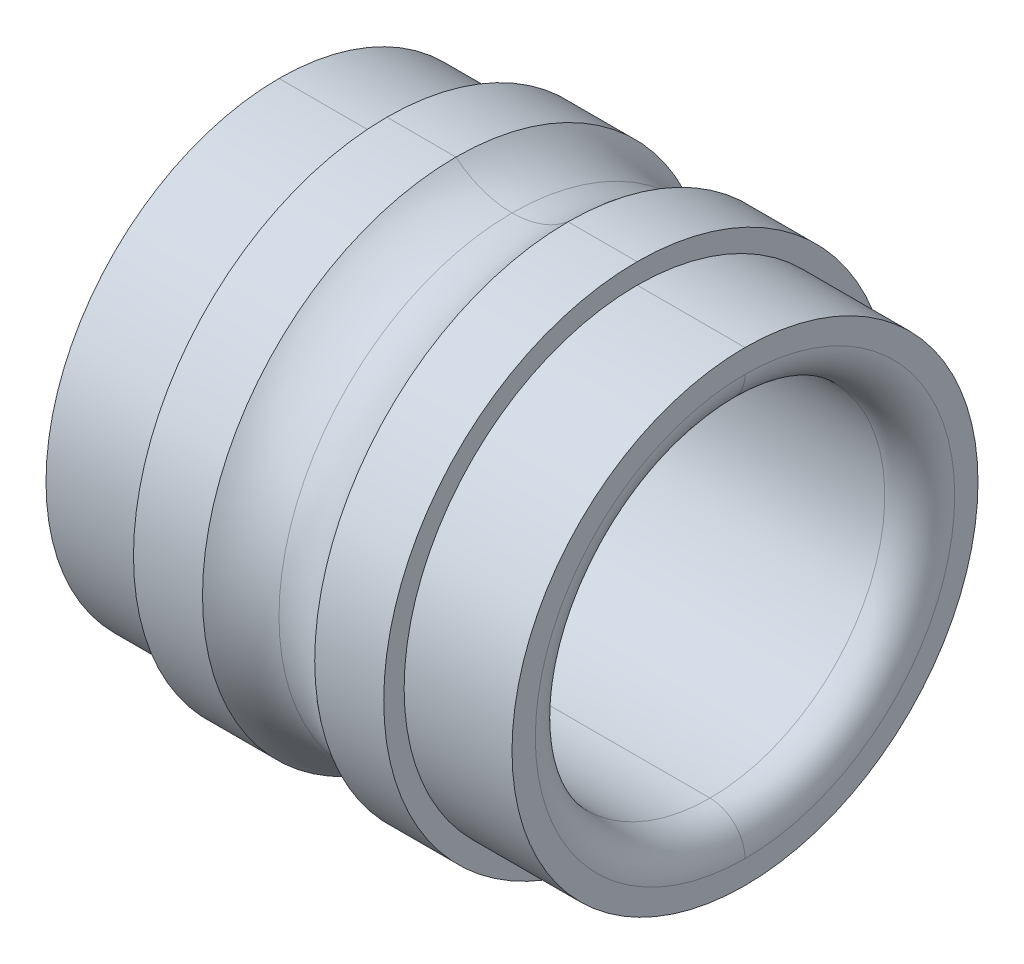
ISO-10303-21;
HEADER;
FILE_DESCRIPTION(('STEP AP214'),'2;1');
FILE_NAME('part.step','',(''),(''),'','','');
FILE_SCHEMA(('AUTOMOTIVE_DESIGN { 1 0 10303 214 1 1 1 1 }'));
ENDSEC;
DATA;
#1=APPLICATION_CONTEXT('core data for automotive mechanical design processes');
#2=APPLICATION_PROTOCOL_DEFINITION('international standard','automotive_design',2000,#1);
#3=PRODUCT_CONTEXT('',#1,'mechanical');
#4=PRODUCT('Part','Part','',(#3));
#5=PRODUCT_RELATED_PRODUCT_CATEGORY('part','',(#4));
#6=PRODUCT_DEFINITION_FORMATION('','',#4);
#7=PRODUCT_DEFINITION_CONTEXT('part definition',#1,'design');
#8=PRODUCT_DEFINITION('design','',#6,#7);
#9=PRODUCT_DEFINITION_SHAPE('','',#8);
#10=(LENGTH_UNIT() NAMED_UNIT(*) SI_UNIT(.MILLI.,.METRE.));
#11=(NAMED_UNIT(*) PLANE_ANGLE_UNIT() SI_UNIT($,.RADIAN.));
#12=(NAMED_UNIT(*) SI_UNIT($,.STERADIAN.) SOLID_ANGLE_UNIT());
#13=UNCERTAINTY_MEASURE_WITH_UNIT(LENGTH_MEASURE(1.E-05),#10,'distance_accuracy_value','');
#14=(GEOMETRIC_REPRESENTATION_CONTEXT(3) GLOBAL_UNCERTAINTY_ASSIGNED_CONTEXT((#13)) GLOBAL_UNIT_ASSIGNED_CONTEXT((#10,
#11,#12)) REPRESENTATION_CONTEXT('',''));
#15=CARTESIAN_POINT('',(0.,0.,0.));
#16=DIRECTION('',(0.,0.,1.));
#17=DIRECTION('',(1.,0.,0.));
#18=AXIS2_PLACEMENT_3D('',#15,#16,#17);
#19=CARTESIAN_POINT('',(2.,0.,0.));
#20=DIRECTION('',(1.,0.,0.));
#21=DIRECTION('',(0.,1.,0.));
#22=AXIS2_PLACEMENT_3D('',#19,#20,#21);
#23=PLANE('',#22);
#24=CARTESIAN_POINT('',(2.,0.,0.));
#25=DIRECTION('',(1.,0.,0.));
#26=DIRECTION('',(0.,-1.,0.));
#27=AXIS2_PLACEMENT_3D('',#24,#25,#26);
#28=CIRCLE('',#27,1.8);
#29=CARTESIAN_POINT('',(2.,1.8,0.));
#30=VERTEX_POINT('',#29);
#31=CARTESIAN_POINT('',(2.,-1.8,0.));
#32=VERTEX_POINT('',#31);
#33=EDGE_CURVE('E203',#30,#32,#28,.T.);
#34=ORIENTED_EDGE('',*,*,#33,.F.);
#35=CARTESIAN_POINT('',(2.,0.,0.));
#36=DIRECTION('',(1.,0.,0.));
#37=DIRECTION('',(0.,-1.,0.));
#38=AXIS2_PLACEMENT_3D('',#35,#36,#37);
#39=CIRCLE('',#38,1.8);
#40=EDGE_CURVE('E253',#32,#30,#39,.T.);
#41=ORIENTED_EDGE('',*,*,#40,.F.);
#42=EDGE_LOOP('',(#34,#41));
#43=FACE_BOUND('',#42,.T.);
#44=CARTESIAN_POINT('',(2.,0.,0.));
#45=DIRECTION('',(1.,0.,0.));
#46=DIRECTION('',(0.,1.,0.));
#47=AXIS2_PLACEMENT_3D('',#44,#45,#46);
#48=CIRCLE('',#47,2.);
#49=CARTESIAN_POINT('',(2.,2.,0.));
#50=VERTEX_POINT('',#49);
#51=CARTESIAN_POINT('',(2.,-2.,0.));
#52=VERTEX_POINT('',#51);
#53=EDGE_CURVE('E204',#50,#52,#48,.T.);
#54=ORIENTED_EDGE('',*,*,#53,.T.);
#55=CARTESIAN_POINT('',(2.,0.,0.));
#56=DIRECTION('',(1.,0.,0.));
#57=DIRECTION('',(0.,1.,0.));
#58=AXIS2_PLACEMENT_3D('',#55,#56,#57);
#59=CIRCLE('',#58,2.);
#60=EDGE_CURVE('E11',#52,#50,#59,.T.);
#61=ORIENTED_EDGE('',*,*,#60,.T.);
#62=EDGE_LOOP('',(#54,#61));
#63=FACE_BOUND('',#62,.T.);
#64=ADVANCED_FACE('F17',(#43,#63),#23,.T.);
#65=CARTESIAN_POINT('',(-2.,0.,0.));
#66=DIRECTION('',(1.,0.,0.));
#67=DIRECTION('',(0.,1.,0.));
#68=AXIS2_PLACEMENT_3D('',#65,#66,#67);
#69=CYLINDRICAL_SURFACE('',#68,2.175);
#70=DIRECTION('',(1.,0.,0.));
#71=VECTOR('',#70,1.);
#72=CARTESIAN_POINT('',(-2.,-2.175,0.));
#73=LINE('',#72,#71);
#74=CARTESIAN_POINT('',(0.481534007106446,-2.175,0.));
#75=VERTEX_POINT('',#74);
#76=CARTESIAN_POINT('',(1.07407407407409,-2.175,0.));
#77=VERTEX_POINT('',#76);
#78=EDGE_CURVE('E165',#75,#77,#73,.T.);
#79=ORIENTED_EDGE('',*,*,#78,.F.);
#80=CARTESIAN_POINT('',(0.481534007106446,0.,0.));
#81=DIRECTION('',(1.,0.,0.));
#82=DIRECTION('',(0.,1.,0.));
#83=AXIS2_PLACEMENT_3D('',#80,#81,#82);
#84=CIRCLE('',#83,2.175);
#85=CARTESIAN_POINT('',(0.481534007106446,2.175,0.));
#86=VERTEX_POINT('',#85);
#87=EDGE_CURVE('E163',#75,#86,#84,.T.);
#88=ORIENTED_EDGE('',*,*,#87,.T.);
#89=DIRECTION('',(1.,0.,0.));
#90=VECTOR('',#89,1.);
#91=CARTESIAN_POINT('',(-2.,2.175,0.));
#92=LINE('',#91,#90);
#93=CARTESIAN_POINT('',(1.07407407407409,2.175,0.));
#94=VERTEX_POINT('',#93);
#95=EDGE_CURVE('E149',#86,#94,#92,.T.);
#96=ORIENTED_EDGE('',*,*,#95,.T.);
#97=CARTESIAN_POINT('',(1.07407407407409,0.,0.));
#98=DIRECTION('',(-1.,0.,0.));
#99=DIRECTION('',(0.,1.,0.));
#100=AXIS2_PLACEMENT_3D('',#97,#98,#99);
#101=CIRCLE('',#100,2.175);
#102=EDGE_CURVE('E263',#94,#77,#101,.T.);
#103=ORIENTED_EDGE('',*,*,#102,.T.);
#104=EDGE_LOOP('',(#79,#88,#96,#103));
#105=FACE_BOUND('',#104,.T.);
#106=ADVANCED_FACE('F164',(#105),#69,.T.);
#107=CARTESIAN_POINT('',(2.,0.,0.));
#108=DIRECTION('',(1.,0.,0.));
#109=DIRECTION('',(0.,1.,0.));
#110=AXIS2_PLACEMENT_3D('',#107,#108,#109);
#111=CYLINDRICAL_SURFACE('',#110,2.);
#112=DIRECTION('',(1.,0.,0.));
#113=VECTOR('',#112,1.);
#114=CARTESIAN_POINT('',(2.,-2.,0.));
#115=LINE('',#114,#113);
#116=CARTESIAN_POINT('',(1.07407407407409,-2.,0.));
#117=VERTEX_POINT('',#116);
#118=EDGE_CURVE('E219',#117,#52,#115,.T.);
#119=ORIENTED_EDGE('',*,*,#118,.F.);
#120=CARTESIAN_POINT('',(1.07407407407409,0.,0.));
#121=DIRECTION('',(1.,0.,0.));
#122=DIRECTION('',(0.,1.,0.));
#123=AXIS2_PLACEMENT_3D('',#120,#121,#122);
#124=CIRCLE('',#123,2.);
#125=CARTESIAN_POINT('',(1.07407407407409,2.,0.));
#126=VERTEX_POINT('',#125);
#127=EDGE_CURVE('E28',#117,#126,#124,.T.);
#128=ORIENTED_EDGE('',*,*,#127,.T.);
#129=DIRECTION('',(1.,0.,0.));
#130=VECTOR('',#129,1.);
#131=CARTESIAN_POINT('',(2.,2.,0.));
#132=LINE('',#131,#130);
#133=EDGE_CURVE('E200',#126,#50,#132,.T.);
#134=ORIENTED_EDGE('',*,*,#133,.T.);
#135=ORIENTED_EDGE('',*,*,#60,.F.);
#136=EDGE_LOOP('',(#119,#128,#134,#135));
#137=FACE_BOUND('',#136,.T.);
#138=ADVANCED_FACE('F564',(#137),#111,.T.);
#139=CARTESIAN_POINT('',(1.07407407407409,0.,0.));
#140=DIRECTION('',(-1.,0.,0.));
#141=DIRECTION('',(0.,0.,1.));
#142=AXIS2_PLACEMENT_3D('',#139,#140,#141);
#143=PLANE('',#142);
#144=CARTESIAN_POINT('',(1.07407407407409,0.,0.));
#145=DIRECTION('',(1.,0.,0.));
#146=DIRECTION('',(0.,1.,0.));
#147=AXIS2_PLACEMENT_3D('',#144,#145,#146);
#148=CIRCLE('',#147,2.);
#149=EDGE_CURVE('E160',#126,#117,#148,.T.);
#150=ORIENTED_EDGE('',*,*,#149,.F.);
#151=ORIENTED_EDGE('',*,*,#127,.F.);
#152=EDGE_LOOP('',(#150,#151));
#153=FACE_BOUND('',#152,.T.);
#154=ORIENTED_EDGE('',*,*,#102,.F.);
#155=CARTESIAN_POINT('',(1.07407407407409,0.,0.));
#156=DIRECTION('',(-1.,0.,0.));
#157=DIRECTION('',(0.,1.,0.));
#158=AXIS2_PLACEMENT_3D('',#155,#156,#157);
#159=CIRCLE('',#158,2.175);
#160=EDGE_CURVE('E157',#77,#94,#159,.T.);
#161=ORIENTED_EDGE('',*,*,#160,.F.);
#162=EDGE_LOOP('',(#154,#161));
#163=FACE_BOUND('',#162,.T.);
#164=ADVANCED_FACE('F553',(#153,#163),#143,.F.);
#165=CARTESIAN_POINT('',(1.7,0.,0.));
#166=DIRECTION('',(1.,0.,0.));
#167=DIRECTION('',(0.,1.,0.));
#168=AXIS2_PLACEMENT_3D('',#165,#166,#167);
#169=TOROIDAL_SURFACE('',#168,1.8,0.3);
#170=CARTESIAN_POINT('',(1.7,-1.8,0.));
#171=DIRECTION('',(0.,0.,1.));
#172=DIRECTION('',(0.,-1.,0.));
#173=AXIS2_PLACEMENT_3D('',#170,#171,#172);
#174=CIRCLE('',#173,0.3);
#175=CARTESIAN_POINT('',(1.7,-1.5,0.));
#176=VERTEX_POINT('',#175);
#177=EDGE_CURVE('E215',#32,#176,#174,.T.);
#178=ORIENTED_EDGE('',*,*,#177,.F.);
#179=ORIENTED_EDGE('',*,*,#40,.T.);
#180=CARTESIAN_POINT('',(1.7,1.8,0.));
#181=DIRECTION('',(0.,0.,-1.));
#182=DIRECTION('',(-1.,0.,0.));
#183=AXIS2_PLACEMENT_3D('',#180,#181,#182);
#184=CIRCLE('',#183,0.3);
#185=CARTESIAN_POINT('',(1.7,1.5,0.));
#186=VERTEX_POINT('',#185);
#187=EDGE_CURVE('E214',#30,#186,#184,.T.);
#188=ORIENTED_EDGE('',*,*,#187,.T.);
#189=CARTESIAN_POINT('',(1.7,0.,0.));
#190=DIRECTION('',(1.,0.,0.));
#191=DIRECTION('',(0.,-1.,0.));
#192=AXIS2_PLACEMENT_3D('',#189,#190,#191);
#193=CIRCLE('',#192,1.5);
#194=EDGE_CURVE('E208',#176,#186,#193,.T.);
#195=ORIENTED_EDGE('',*,*,#194,.F.);
#196=EDGE_LOOP('',(#178,#179,#188,#195));
#197=FACE_BOUND('',#196,.T.);
#198=ADVANCED_FACE('F541',(#197),#169,.T.);
#199=CARTESIAN_POINT('',(0.,0.,0.));
#200=DIRECTION('',(1.,0.,0.));
#201=DIRECTION('',(0.,1.,0.));
#202=AXIS2_PLACEMENT_3D('',#199,#200,#201);
#203=TOROIDAL_SURFACE('',#202,2.75,0.75);
#204=CARTESIAN_POINT('',(0.,0.,0.));
#205=DIRECTION('',(1.,0.,0.));
#206=DIRECTION('',(0.,0.,-1.));
#207=AXIS2_PLACEMENT_3D('',#204,#205,#206);
#208=CIRCLE('',#207,2.);
#209=CARTESIAN_POINT('',(0.,2.,0.));
#210=VERTEX_POINT('',#209);
#211=CARTESIAN_POINT('',(0.,-2.,0.));
#212=VERTEX_POINT('',#211);
#213=EDGE_CURVE('E185',#210,#212,#208,.T.);
#214=ORIENTED_EDGE('',*,*,#213,.F.);
#215=CARTESIAN_POINT('',(0.,2.75,0.));
#216=DIRECTION('',(0.,0.,-1.));
#217=DIRECTION('',(-1.,0.,0.));
#218=AXIS2_PLACEMENT_3D('',#215,#216,#217);
#219=CIRCLE('',#218,0.75);
#220=CARTESIAN_POINT('',(-0.481534007106446,2.175,0.));
#221=VERTEX_POINT('',#220);
#222=EDGE_CURVE('E199',#210,#221,#219,.T.);
#223=ORIENTED_EDGE('',*,*,#222,.T.);
#224=CARTESIAN_POINT('',(-0.481534007106446,0.,0.));
#225=DIRECTION('',(-1.,0.,0.));
#226=DIRECTION('',(0.,1.,0.));
#227=AXIS2_PLACEMENT_3D('',#224,#225,#226);
#228=CIRCLE('',#227,2.175);
#229=CARTESIAN_POINT('',(-0.481534007106446,-2.175,0.));
#230=VERTEX_POINT('',#229);
#231=EDGE_CURVE('E270',#230,#221,#228,.T.);
#232=ORIENTED_EDGE('',*,*,#231,.F.);
#233=CARTESIAN_POINT('',(0.,-2.75,0.));
#234=DIRECTION('',(0.,0.,1.));
#235=DIRECTION('',(0.,-1.,0.));
#236=AXIS2_PLACEMENT_3D('',#233,#234,#235);
#237=CIRCLE('',#236,0.75);
#238=EDGE_CURVE('E232',#212,#230,#237,.T.);
#239=ORIENTED_EDGE('',*,*,#238,.F.);
#240=EDGE_LOOP('',(#214,#223,#232,#239));
#241=FACE_BOUND('',#240,.T.);
#242=ADVANCED_FACE('F530',(#241),#203,.F.);
#243=CARTESIAN_POINT('',(2.,0.,0.));
#244=DIRECTION('',(1.,0.,0.));
#245=DIRECTION('',(0.,1.,0.));
#246=AXIS2_PLACEMENT_3D('',#243,#244,#245);
#247=CYLINDRICAL_SURFACE('',#246,1.5);
#248=DIRECTION('',(1.,0.,0.));
#249=VECTOR('',#248,1.);
#250=CARTESIAN_POINT('',(2.,-1.5,0.));
#251=LINE('',#250,#249);
#252=CARTESIAN_POINT('',(-1.7,-1.5,0.));
#253=VERTEX_POINT('',#252);
#254=EDGE_CURVE('E198',#253,#176,#251,.T.);
#255=ORIENTED_EDGE('',*,*,#254,.F.);
#256=CARTESIAN_POINT('',(-1.7,0.,0.));
#257=DIRECTION('',(1.,0.,0.));
#258=DIRECTION('',(0.,-1.,0.));
#259=AXIS2_PLACEMENT_3D('',#256,#257,#258);
#260=CIRCLE('',#259,1.5);
#261=CARTESIAN_POINT('',(-1.7,1.5,0.));
#262=VERTEX_POINT('',#261);
#263=EDGE_CURVE('E789',#262,#253,#260,.T.);
#264=ORIENTED_EDGE('',*,*,#263,.F.);
#265=DIRECTION('',(1.,0.,0.));
#266=VECTOR('',#265,1.);
#267=CARTESIAN_POINT('',(2.,1.5,0.));
#268=LINE('',#267,#266);
#269=EDGE_CURVE('E205',#262,#186,#268,.T.);
#270=ORIENTED_EDGE('',*,*,#269,.T.);
#271=CARTESIAN_POINT('',(1.7,0.,0.));
#272=DIRECTION('',(1.,0.,0.));
#273=DIRECTION('',(0.,-1.,0.));
#274=AXIS2_PLACEMENT_3D('',#271,#272,#273);
#275=CIRCLE('',#274,1.5);
#276=EDGE_CURVE('E210',#186,#176,#275,.T.);
#277=ORIENTED_EDGE('',*,*,#276,.T.);
#278=EDGE_LOOP('',(#255,#264,#270,#277));
#279=FACE_BOUND('',#278,.T.);
#280=ADVANCED_FACE('F519',(#279),#247,.F.);
#281=CARTESIAN_POINT('',(-2.,0.,0.));
#282=DIRECTION('',(1.,0.,0.));
#283=DIRECTION('',(0.,1.,0.));
#284=AXIS2_PLACEMENT_3D('',#281,#282,#283);
#285=CYLINDRICAL_SURFACE('',#284,2.175);
#286=DIRECTION('',(1.,0.,0.));
#287=VECTOR('',#286,1.);
#288=CARTESIAN_POINT('',(-2.,-2.175,0.));
#289=LINE('',#288,#287);
#290=CARTESIAN_POINT('',(-1.07407407407407,-2.175,0.));
#291=VERTEX_POINT('',#290);
#292=EDGE_CURVE('E228',#291,#230,#289,.T.);
#293=ORIENTED_EDGE('',*,*,#292,.F.);
#294=CARTESIAN_POINT('',(-1.07407407407407,0.,0.));
#295=DIRECTION('',(1.,0.,0.));
#296=DIRECTION('',(0.,1.,0.));
#297=AXIS2_PLACEMENT_3D('',#294,#295,#296);
#298=CIRCLE('',#297,2.175);
#299=CARTESIAN_POINT('',(-1.07407407407407,2.175,0.));
#300=VERTEX_POINT('',#299);
#301=EDGE_CURVE('E251',#291,#300,#298,.T.);
#302=ORIENTED_EDGE('',*,*,#301,.T.);
#303=DIRECTION('',(1.,0.,0.));
#304=VECTOR('',#303,1.);
#305=CARTESIAN_POINT('',(-2.,2.175,0.));
#306=LINE('',#305,#304);
#307=EDGE_CURVE('E777',#300,#221,#306,.T.);
#308=ORIENTED_EDGE('',*,*,#307,.T.);
#309=CARTESIAN_POINT('',(-0.481534007106446,0.,0.));
#310=DIRECTION('',(-1.,0.,0.));
#311=DIRECTION('',(0.,1.,0.));
#312=AXIS2_PLACEMENT_3D('',#309,#310,#311);
#313=CIRCLE('',#312,2.175);
#314=EDGE_CURVE('E235',#221,#230,#313,.T.);
#315=ORIENTED_EDGE('',*,*,#314,.T.);
#316=EDGE_LOOP('',(#293,#302,#308,#315));
#317=FACE_BOUND('',#316,.T.);
#318=ADVANCED_FACE('F508',(#317),#285,.T.);
#319=CARTESIAN_POINT('',(-1.7,0.,0.));
#320=DIRECTION('',(1.,0.,0.));
#321=DIRECTION('',(0.,1.,0.));
#322=AXIS2_PLACEMENT_3D('',#319,#320,#321);
#323=TOROIDAL_SURFACE('',#322,1.8,0.3);
#324=CARTESIAN_POINT('',(-1.7,-1.8,0.));
#325=DIRECTION('',(0.,0.,1.));
#326=DIRECTION('',(0.,-1.,0.));
#327=AXIS2_PLACEMENT_3D('',#324,#325,#326);
#328=CIRCLE('',#327,0.3);
#329=CARTESIAN_POINT('',(-2.,-1.8,0.));
#330=VERTEX_POINT('',#329);
#331=EDGE_CURVE('E793',#253,#330,#328,.T.);
#332=ORIENTED_EDGE('',*,*,#331,.F.);
#333=CARTESIAN_POINT('',(-1.7,0.,0.));
#334=DIRECTION('',(1.,0.,0.));
#335=DIRECTION('',(0.,-1.,0.));
#336=AXIS2_PLACEMENT_3D('',#333,#334,#335);
#337=CIRCLE('',#336,1.5);
#338=EDGE_CURVE('E194',#253,#262,#337,.T.);
#339=ORIENTED_EDGE('',*,*,#338,.T.);
#340=CARTESIAN_POINT('',(-1.7,1.8,0.));
#341=DIRECTION('',(0.,0.,-1.));
#342=DIRECTION('',(-1.,0.,0.));
#343=AXIS2_PLACEMENT_3D('',#340,#341,#342);
#344=CIRCLE('',#343,0.3);
#345=CARTESIAN_POINT('',(-2.,1.8,0.));
#346=VERTEX_POINT('',#345);
#347=EDGE_CURVE('E286',#262,#346,#344,.T.);
#348=ORIENTED_EDGE('',*,*,#347,.T.);
#349=CARTESIAN_POINT('',(-2.,0.,0.));
#350=DIRECTION('',(1.,0.,0.));
#351=DIRECTION('',(0.,-1.,0.));
#352=AXIS2_PLACEMENT_3D('',#349,#350,#351);
#353=CIRCLE('',#352,1.8);
#354=EDGE_CURVE('E254',#330,#346,#353,.T.);
#355=ORIENTED_EDGE('',*,*,#354,.F.);
#356=EDGE_LOOP('',(#332,#339,#348,#355));
#357=FACE_BOUND('',#356,.T.);
#358=ADVANCED_FACE('F499',(#357),#323,.T.);
#359=CARTESIAN_POINT('',(-1.07407407407407,0.,0.));
#360=DIRECTION('',(1.,0.,0.));
#361=DIRECTION('',(0.,1.,0.));
#362=AXIS2_PLACEMENT_3D('',#359,#360,#361);
#363=PLANE('',#362);
#364=CARTESIAN_POINT('',(-1.07407407407407,0.,0.));
#365=DIRECTION('',(1.,0.,0.));
#366=DIRECTION('',(0.,1.,0.));
#367=AXIS2_PLACEMENT_3D('',#364,#365,#366);
#368=CIRCLE('',#367,2.);
#369=CARTESIAN_POINT('',(-1.07407407407407,2.,0.));
#370=VERTEX_POINT('',#369);
#371=CARTESIAN_POINT('',(-1.07407407407407,-2.,0.));
#372=VERTEX_POINT('',#371);
#373=EDGE_CURVE('E260',#370,#372,#368,.T.);
#374=ORIENTED_EDGE('',*,*,#373,.T.);
#375=CARTESIAN_POINT('',(-1.07407407407407,0.,0.));
#376=DIRECTION('',(1.,0.,0.));
#377=DIRECTION('',(0.,1.,0.));
#378=AXIS2_PLACEMENT_3D('',#375,#376,#377);
#379=CIRCLE('',#378,2.);
#380=EDGE_CURVE('E42',#372,#370,#379,.T.);
#381=ORIENTED_EDGE('',*,*,#380,.T.);
#382=EDGE_LOOP('',(#374,#381));
#383=FACE_BOUND('',#382,.T.);
#384=CARTESIAN_POINT('',(-1.07407407407407,0.,0.));
#385=DIRECTION('',(1.,0.,0.));
#386=DIRECTION('',(0.,1.,0.));
#387=AXIS2_PLACEMENT_3D('',#384,#385,#386);
#388=CIRCLE('',#387,2.175);
#389=EDGE_CURVE('E207',#300,#291,#388,.T.);
#390=ORIENTED_EDGE('',*,*,#389,.F.);
#391=ORIENTED_EDGE('',*,*,#301,.F.);
#392=EDGE_LOOP('',(#390,#391));
#393=FACE_BOUND('',#392,.T.);
#394=ADVANCED_FACE('F19',(#383,#393),#363,.F.);
#395=CARTESIAN_POINT('',(-2.,0.,0.));
#396=DIRECTION('',(-1.,0.,0.));
#397=DIRECTION('',(0.,0.,1.));
#398=AXIS2_PLACEMENT_3D('',#395,#396,#397);
#399=PLANE('',#398);
#400=CARTESIAN_POINT('',(-2.,0.,0.));
#401=DIRECTION('',(1.,0.,0.));
#402=DIRECTION('',(0.,-1.,0.));
#403=AXIS2_PLACEMENT_3D('',#400,#401,#402);
#404=CIRCLE('',#403,1.8);
#405=EDGE_CURVE('E21',#346,#330,#404,.T.);
#406=ORIENTED_EDGE('',*,*,#405,.T.);
#407=ORIENTED_EDGE('',*,*,#354,.T.);
#408=EDGE_LOOP('',(#406,#407));
#409=FACE_BOUND('',#408,.T.);
#410=CARTESIAN_POINT('',(-2.,0.,0.));
#411=DIRECTION('',(-1.,0.,0.));
#412=DIRECTION('',(0.,1.,0.));
#413=AXIS2_PLACEMENT_3D('',#410,#411,#412);
#414=CIRCLE('',#413,2.);
#415=CARTESIAN_POINT('',(-2.,2.,0.));
#416=VERTEX_POINT('',#415);
#417=CARTESIAN_POINT('',(-2.,-2.,0.));
#418=VERTEX_POINT('',#417);
#419=EDGE_CURVE('E259',#416,#418,#414,.T.);
#420=ORIENTED_EDGE('',*,*,#419,.T.);
#421=CARTESIAN_POINT('',(-2.,0.,0.));
#422=DIRECTION('',(-1.,0.,0.));
#423=DIRECTION('',(0.,1.,0.));
#424=AXIS2_PLACEMENT_3D('',#421,#422,#423);
#425=CIRCLE('',#424,2.);
#426=EDGE_CURVE('E275',#418,#416,#425,.T.);
#427=ORIENTED_EDGE('',*,*,#426,.T.);
#428=EDGE_LOOP('',(#420,#427));
#429=FACE_BOUND('',#428,.T.);
#430=ADVANCED_FACE('F476',(#409,#429),#399,.T.);
#431=CARTESIAN_POINT('',(-1.07407407407407,0.,0.));
#432=DIRECTION('',(1.,0.,0.));
#433=DIRECTION('',(0.,1.,0.));
#434=AXIS2_PLACEMENT_3D('',#431,#432,#433);
#435=CYLINDRICAL_SURFACE('',#434,2.);
#436=DIRECTION('',(1.,0.,0.));
#437=VECTOR('',#436,1.);
#438=CARTESIAN_POINT('',(-1.07407407407407,-2.,0.));
#439=LINE('',#438,#437);
#440=EDGE_CURVE('E272',#418,#372,#439,.T.);
#441=ORIENTED_EDGE('',*,*,#440,.F.);
#442=ORIENTED_EDGE('',*,*,#419,.F.);
#443=DIRECTION('',(1.,0.,0.));
#444=VECTOR('',#443,1.);
#445=CARTESIAN_POINT('',(-1.07407407407407,2.,0.));
#446=LINE('',#445,#444);
#447=EDGE_CURVE('E256',#416,#370,#446,.T.);
#448=ORIENTED_EDGE('',*,*,#447,.T.);
#449=ORIENTED_EDGE('',*,*,#380,.F.);
#450=EDGE_LOOP('',(#441,#442,#448,#449));
#451=FACE_BOUND('',#450,.T.);
#452=ADVANCED_FACE('F464',(#451),#435,.T.);
#453=CARTESIAN_POINT('',(-1.07407407407407,0.,0.));
#454=DIRECTION('',(1.,0.,0.));
#455=DIRECTION('',(0.,1.,0.));
#456=AXIS2_PLACEMENT_3D('',#453,#454,#455);
#457=CYLINDRICAL_SURFACE('',#456,2.);
#458=ORIENTED_EDGE('',*,*,#426,.F.);
#459=ORIENTED_EDGE('',*,*,#440,.T.);
#460=ORIENTED_EDGE('',*,*,#373,.F.);
#461=ORIENTED_EDGE('',*,*,#447,.F.);
#462=EDGE_LOOP('',(#458,#459,#460,#461));
#463=FACE_BOUND('',#462,.T.);
#464=ADVANCED_FACE('F452',(#463),#457,.T.);
#465=CARTESIAN_POINT('',(-1.7,0.,0.));
#466=DIRECTION('',(1.,0.,0.));
#467=DIRECTION('',(0.,1.,0.));
#468=AXIS2_PLACEMENT_3D('',#465,#466,#467);
#469=TOROIDAL_SURFACE('',#468,1.8,0.3);
#470=ORIENTED_EDGE('',*,*,#263,.T.);
#471=ORIENTED_EDGE('',*,*,#331,.T.);
#472=ORIENTED_EDGE('',*,*,#405,.F.);
#473=ORIENTED_EDGE('',*,*,#347,.F.);
#474=EDGE_LOOP('',(#470,#471,#472,#473));
#475=FACE_BOUND('',#474,.T.);
#476=ADVANCED_FACE('F440',(#475),#469,.T.);
#477=CARTESIAN_POINT('',(-2.,0.,0.));
#478=DIRECTION('',(1.,0.,0.));
#479=DIRECTION('',(0.,1.,0.));
#480=AXIS2_PLACEMENT_3D('',#477,#478,#479);
#481=CYLINDRICAL_SURFACE('',#480,2.175);
#482=ORIENTED_EDGE('',*,*,#389,.T.);
#483=ORIENTED_EDGE('',*,*,#292,.T.);
#484=ORIENTED_EDGE('',*,*,#231,.T.);
#485=ORIENTED_EDGE('',*,*,#307,.F.);
#486=EDGE_LOOP('',(#482,#483,#484,#485));
#487=FACE_BOUND('',#486,.T.);
#488=ADVANCED_FACE('F428',(#487),#481,.T.);
#489=CARTESIAN_POINT('',(2.,0.,0.));
#490=DIRECTION('',(1.,0.,0.));
#491=DIRECTION('',(0.,1.,0.));
#492=AXIS2_PLACEMENT_3D('',#489,#490,#491);
#493=CYLINDRICAL_SURFACE('',#492,1.5);
#494=ORIENTED_EDGE('',*,*,#338,.F.);
#495=ORIENTED_EDGE('',*,*,#254,.T.);
#496=ORIENTED_EDGE('',*,*,#194,.T.);
#497=ORIENTED_EDGE('',*,*,#269,.F.);
#498=EDGE_LOOP('',(#494,#495,#496,#497));
#499=FACE_BOUND('',#498,.T.);
#500=ADVANCED_FACE('F415',(#499),#493,.F.);
#501=CARTESIAN_POINT('',(0.,0.,0.));
#502=DIRECTION('',(1.,0.,0.));
#503=DIRECTION('',(0.,1.,0.));
#504=AXIS2_PLACEMENT_3D('',#501,#502,#503);
#505=TOROIDAL_SURFACE('',#504,2.75,0.75);
#506=CARTESIAN_POINT('',(0.,0.,0.));
#507=DIRECTION('',(1.,0.,0.));
#508=DIRECTION('',(0.,0.,-1.));
#509=AXIS2_PLACEMENT_3D('',#506,#507,#508);
#510=CIRCLE('',#509,2.);
#511=EDGE_CURVE('E170',#212,#210,#510,.T.);
#512=ORIENTED_EDGE('',*,*,#511,.F.);
#513=ORIENTED_EDGE('',*,*,#238,.T.);
#514=ORIENTED_EDGE('',*,*,#314,.F.);
#515=ORIENTED_EDGE('',*,*,#222,.F.);
#516=EDGE_LOOP('',(#512,#513,#514,#515));
#517=FACE_BOUND('',#516,.T.);
#518=ADVANCED_FACE('F402',(#517),#505,.F.);
#519=CARTESIAN_POINT('',(1.7,0.,0.));
#520=DIRECTION('',(1.,0.,0.));
#521=DIRECTION('',(0.,1.,0.));
#522=AXIS2_PLACEMENT_3D('',#519,#520,#521);
#523=TOROIDAL_SURFACE('',#522,1.8,0.3);
#524=ORIENTED_EDGE('',*,*,#33,.T.);
#525=ORIENTED_EDGE('',*,*,#177,.T.);
#526=ORIENTED_EDGE('',*,*,#276,.F.);
#527=ORIENTED_EDGE('',*,*,#187,.F.);
#528=EDGE_LOOP('',(#524,#525,#526,#527));
#529=FACE_BOUND('',#528,.T.);
#530=ADVANCED_FACE('F390',(#529),#523,.T.);
#531=CARTESIAN_POINT('',(2.,0.,0.));
#532=DIRECTION('',(1.,0.,0.));
#533=DIRECTION('',(0.,1.,0.));
#534=AXIS2_PLACEMENT_3D('',#531,#532,#533);
#535=CYLINDRICAL_SURFACE('',#534,2.);
#536=ORIENTED_EDGE('',*,*,#149,.T.);
#537=ORIENTED_EDGE('',*,*,#118,.T.);
#538=ORIENTED_EDGE('',*,*,#53,.F.);
#539=ORIENTED_EDGE('',*,*,#133,.F.);
#540=EDGE_LOOP('',(#536,#537,#538,#539));
#541=FACE_BOUND('',#540,.T.);
#542=ADVANCED_FACE('F378',(#541),#535,.T.);
#543=CARTESIAN_POINT('',(-2.,0.,0.));
#544=DIRECTION('',(1.,0.,0.));
#545=DIRECTION('',(0.,1.,0.));
#546=AXIS2_PLACEMENT_3D('',#543,#544,#545);
#547=CYLINDRICAL_SURFACE('',#546,2.175);
#548=CARTESIAN_POINT('',(0.481534007106446,0.,0.));
#549=DIRECTION('',(1.,0.,0.));
#550=DIRECTION('',(0.,1.,0.));
#551=AXIS2_PLACEMENT_3D('',#548,#549,#550);
#552=CIRCLE('',#551,2.175);
#553=EDGE_CURVE('E154',#86,#75,#552,.T.);
#554=ORIENTED_EDGE('',*,*,#553,.T.);
#555=ORIENTED_EDGE('',*,*,#78,.T.);
#556=ORIENTED_EDGE('',*,*,#160,.T.);
#557=ORIENTED_EDGE('',*,*,#95,.F.);
#558=EDGE_LOOP('',(#554,#555,#556,#557));
#559=FACE_BOUND('',#558,.T.);
#560=ADVANCED_FACE('F151',(#559),#547,.T.);
#561=CARTESIAN_POINT('',(0.,0.,0.));
#562=DIRECTION('',(1.,0.,0.));
#563=DIRECTION('',(0.,1.,0.));
#564=AXIS2_PLACEMENT_3D('',#561,#562,#563);
#565=TOROIDAL_SURFACE('',#564,2.75,0.75);
#566=CARTESIAN_POINT('',(0.,-2.75,0.));
#567=DIRECTION('',(0.,0.,1.));
#568=DIRECTION('',(0.,-1.,0.));
#569=AXIS2_PLACEMENT_3D('',#566,#567,#568);
#570=CIRCLE('',#569,0.75);
#571=EDGE_CURVE('E177',#75,#212,#570,.T.);
#572=ORIENTED_EDGE('',*,*,#571,.T.);
#573=ORIENTED_EDGE('',*,*,#511,.T.);
#574=CARTESIAN_POINT('',(0.,2.75,0.));
#575=DIRECTION('',(0.,0.,-1.));
#576=DIRECTION('',(-1.,0.,0.));
#577=AXIS2_PLACEMENT_3D('',#574,#575,#576);
#578=CIRCLE('',#577,0.75);
#579=EDGE_CURVE('E176',#86,#210,#578,.T.);
#580=ORIENTED_EDGE('',*,*,#579,.F.);
#581=ORIENTED_EDGE('',*,*,#87,.F.);
#582=EDGE_LOOP('',(#572,#573,#580,#581));
#583=FACE_BOUND('',#582,.T.);
#584=ADVANCED_FACE('F181',(#583),#565,.F.);
#585=CARTESIAN_POINT('',(0.,0.,0.));
#586=DIRECTION('',(1.,0.,0.));
#587=DIRECTION('',(0.,1.,0.));
#588=AXIS2_PLACEMENT_3D('',#585,#586,#587);
#589=TOROIDAL_SURFACE('',#588,2.75,0.75);
#590=ORIENTED_EDGE('',*,*,#579,.T.);
#591=ORIENTED_EDGE('',*,*,#213,.T.);
#592=ORIENTED_EDGE('',*,*,#571,.F.);
#593=ORIENTED_EDGE('',*,*,#553,.F.);
#594=EDGE_LOOP('',(#590,#591,#592,#593));
#595=FACE_BOUND('',#594,.T.);
#596=ADVANCED_FACE('F174',(#595),#589,.F.);
#597=CLOSED_SHELL('',(#64,#106,#138,#164,#198,#242,#280,#318,#358,#394,#430,#452,#464,#476,#488,
#500,#518,#530,#542,#560,#584,#596));
#598=MANIFOLD_SOLID_BREP('B1',#597);
#599=ADVANCED_BREP_SHAPE_REPRESENTATION('',(#18,#598),#14);
#600=SHAPE_DEFINITION_REPRESENTATION(#9,#599);
ENDSEC;
END-ISO-10303-21;
